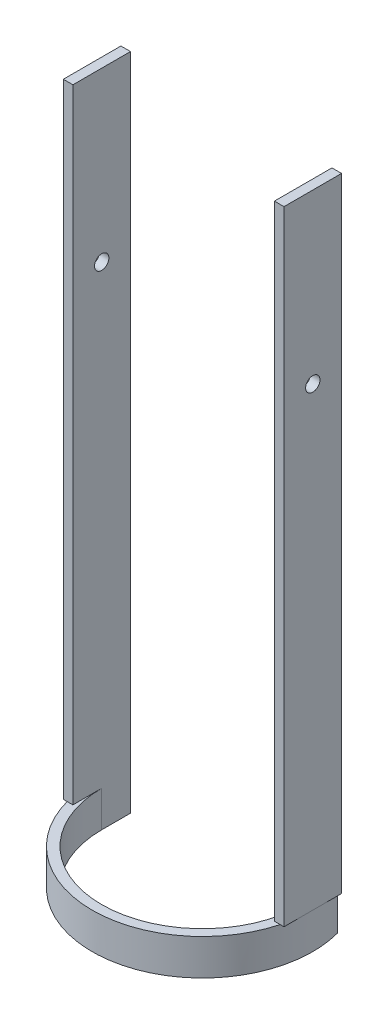
ISO-10303-21;
HEADER;
FILE_DESCRIPTION(('STEP AP214'),'2;1');
FILE_NAME('part.step','',(''),(''),'','','');
FILE_SCHEMA(('AUTOMOTIVE_DESIGN { 1 0 10303 214 1 1 1 1 }'));
ENDSEC;
DATA;
#1=APPLICATION_CONTEXT('core data for automotive mechanical design processes');
#2=APPLICATION_PROTOCOL_DEFINITION('international standard','automotive_design',2000,#1);
#3=PRODUCT_CONTEXT('',#1,'mechanical');
#4=PRODUCT('Part','Part','',(#3));
#5=PRODUCT_RELATED_PRODUCT_CATEGORY('part','',(#4));
#6=PRODUCT_DEFINITION_FORMATION('','',#4);
#7=PRODUCT_DEFINITION_CONTEXT('part definition',#1,'design');
#8=PRODUCT_DEFINITION('design','',#6,#7);
#9=PRODUCT_DEFINITION_SHAPE('','',#8);
#10=(LENGTH_UNIT() NAMED_UNIT(*) SI_UNIT(.MILLI.,.METRE.));
#11=(NAMED_UNIT(*) PLANE_ANGLE_UNIT() SI_UNIT($,.RADIAN.));
#12=(NAMED_UNIT(*) SI_UNIT($,.STERADIAN.) SOLID_ANGLE_UNIT());
#13=UNCERTAINTY_MEASURE_WITH_UNIT(LENGTH_MEASURE(1.E-05),#10,'distance_accuracy_value','');
#14=(GEOMETRIC_REPRESENTATION_CONTEXT(3) GLOBAL_UNCERTAINTY_ASSIGNED_CONTEXT((#13)) GLOBAL_UNIT_ASSIGNED_CONTEXT((#10,
#11,#12)) REPRESENTATION_CONTEXT('',''));
#15=CARTESIAN_POINT('',(0.,0.,0.));
#16=DIRECTION('',(0.,0.,1.));
#17=DIRECTION('',(1.,0.,0.));
#18=AXIS2_PLACEMENT_3D('',#15,#16,#17);
#19=CARTESIAN_POINT('',(-46.,30.,-12.));
#20=DIRECTION('',(0.,0.,1.));
#21=DIRECTION('',(1.,0.,0.));
#22=AXIS2_PLACEMENT_3D('',#19,#20,#21);
#23=PLANE('',#22);
#24=DIRECTION('',(1.,0.,0.));
#25=VECTOR('',#24,1.);
#26=CARTESIAN_POINT('',(-46.,30.,-12.));
#27=LINE('',#26,#25);
#28=CARTESIAN_POINT('',(-46.,30.,-12.));
#29=VERTEX_POINT('',#28);
#30=CARTESIAN_POINT('',(-44.407206622349,30.,-12.));
#31=VERTEX_POINT('',#30);
#32=EDGE_CURVE('E161',#29,#31,#27,.T.);
#33=ORIENTED_EDGE('',*,*,#32,.F.);
#34=DIRECTION('',(0.,-1.,0.));
#35=VECTOR('',#34,1.);
#36=CARTESIAN_POINT('',(-46.,30.,-12.));
#37=LINE('',#36,#35);
#38=CARTESIAN_POINT('',(-46.,290.,-12.));
#39=VERTEX_POINT('',#38);
#40=EDGE_CURVE('E247',#39,#29,#37,.T.);
#41=ORIENTED_EDGE('',*,*,#40,.F.);
#42=DIRECTION('',(-1.,0.,0.));
#43=VECTOR('',#42,1.);
#44=CARTESIAN_POINT('',(-46.,290.,-12.));
#45=LINE('',#44,#43);
#46=CARTESIAN_POINT('',(-42.,290.,-12.));
#47=VERTEX_POINT('',#46);
#48=EDGE_CURVE('E188',#47,#39,#45,.T.);
#49=ORIENTED_EDGE('',*,*,#48,.F.);
#50=DIRECTION('',(0.,-1.,0.));
#51=VECTOR('',#50,1.);
#52=CARTESIAN_POINT('',(-42.,30.,-12.));
#53=LINE('',#52,#51);
#54=CARTESIAN_POINT('',(-42.,15.,-12.));
#55=VERTEX_POINT('',#54);
#56=EDGE_CURVE('E222',#47,#55,#53,.T.);
#57=ORIENTED_EDGE('',*,*,#56,.T.);
#58=DIRECTION('',(1.,0.,0.));
#59=VECTOR('',#58,1.);
#60=CARTESIAN_POINT('',(66.6226252004804,15.,-12.));
#61=LINE('',#60,#59);
#62=CARTESIAN_POINT('',(-44.407206622349,15.,-12.));
#63=VERTEX_POINT('',#62);
#64=EDGE_CURVE('E172',#63,#55,#61,.T.);
#65=ORIENTED_EDGE('',*,*,#64,.F.);
#66=DIRECTION('',(0.,-1.,0.));
#67=VECTOR('',#66,1.);
#68=CARTESIAN_POINT('',(-44.407206622349,30.,-12.));
#69=LINE('',#68,#67);
#70=EDGE_CURVE('E143',#31,#63,#69,.T.);
#71=ORIENTED_EDGE('',*,*,#70,.F.);
#72=EDGE_LOOP('',(#33,#41,#49,#57,#65,#71));
#73=FACE_BOUND('',#72,.T.);
#74=ADVANCED_FACE('F34',(#73),#23,.F.);
#75=CARTESIAN_POINT('',(-46.,30.,0.));
#76=DIRECTION('',(1.,0.,0.));
#77=DIRECTION('',(0.,0.,-1.));
#78=AXIS2_PLACEMENT_3D('',#75,#76,#77);
#79=PLANE('',#78);
#80=CARTESIAN_POINT('',(-46.,220.,0.));
#81=DIRECTION('',(1.,0.,0.));
#82=DIRECTION('',(0.,0.,-1.));
#83=AXIS2_PLACEMENT_3D('',#80,#81,#82);
#84=CIRCLE('',#83,3.);
#85=CARTESIAN_POINT('',(-46.,220.,-3.));
#86=VERTEX_POINT('',#85);
#87=EDGE_CURVE('E159',#86,#86,#84,.T.);
#88=ORIENTED_EDGE('',*,*,#87,.T.);
#89=EDGE_LOOP('',(#88));
#90=FACE_BOUND('',#89,.T.);
#91=DIRECTION('',(0.,0.,-1.));
#92=VECTOR('',#91,1.);
#93=CARTESIAN_POINT('',(-46.,30.,0.));
#94=LINE('',#93,#92);
#95=CARTESIAN_POINT('',(-46.,30.,0.));
#96=VERTEX_POINT('',#95);
#97=EDGE_CURVE('E271',#96,#29,#94,.T.);
#98=ORIENTED_EDGE('',*,*,#97,.F.);
#99=DIRECTION('',(0.,0.,1.));
#100=VECTOR('',#99,1.);
#101=CARTESIAN_POINT('',(-46.,30.,-12.));
#102=LINE('',#101,#100);
#103=CARTESIAN_POINT('',(-46.,30.,12.));
#104=VERTEX_POINT('',#103);
#105=EDGE_CURVE('E178',#96,#104,#102,.T.);
#106=ORIENTED_EDGE('',*,*,#105,.T.);
#107=DIRECTION('',(0.,-1.,0.));
#108=VECTOR('',#107,1.);
#109=CARTESIAN_POINT('',(-46.,290.,12.));
#110=LINE('',#109,#108);
#111=CARTESIAN_POINT('',(-46.,290.,12.));
#112=VERTEX_POINT('',#111);
#113=EDGE_CURVE('E200',#112,#104,#110,.T.);
#114=ORIENTED_EDGE('',*,*,#113,.F.);
#115=DIRECTION('',(0.,0.,1.));
#116=VECTOR('',#115,1.);
#117=CARTESIAN_POINT('',(-46.,290.,-12.));
#118=LINE('',#117,#116);
#119=EDGE_CURVE('E179',#39,#112,#118,.T.);
#120=ORIENTED_EDGE('',*,*,#119,.F.);
#121=ORIENTED_EDGE('',*,*,#40,.T.);
#122=EDGE_LOOP('',(#98,#106,#114,#120,#121));
#123=FACE_BOUND('',#122,.T.);
#124=ADVANCED_FACE('F270',(#90,#123),#79,.F.);
#125=CARTESIAN_POINT('',(46.,30.,0.));
#126=DIRECTION('',(-1.,0.,0.));
#127=DIRECTION('',(0.,0.,1.));
#128=AXIS2_PLACEMENT_3D('',#125,#126,#127);
#129=PLANE('',#128);
#130=CARTESIAN_POINT('',(46.,220.,0.));
#131=DIRECTION('',(1.,0.,0.));
#132=DIRECTION('',(0.,0.,-1.));
#133=AXIS2_PLACEMENT_3D('',#130,#131,#132);
#134=CIRCLE('',#133,3.);
#135=CARTESIAN_POINT('',(46.,220.,-3.));
#136=VERTEX_POINT('',#135);
#137=EDGE_CURVE('E156',#136,#136,#134,.T.);
#138=ORIENTED_EDGE('',*,*,#137,.F.);
#139=EDGE_LOOP('',(#138));
#140=FACE_BOUND('',#139,.T.);
#141=DIRECTION('',(0.,0.,1.));
#142=VECTOR('',#141,1.);
#143=CARTESIAN_POINT('',(46.,30.,0.));
#144=LINE('',#143,#142);
#145=CARTESIAN_POINT('',(46.,30.,-12.));
#146=VERTEX_POINT('',#145);
#147=CARTESIAN_POINT('',(46.,30.,0.));
#148=VERTEX_POINT('',#147);
#149=EDGE_CURVE('E149',#146,#148,#144,.T.);
#150=ORIENTED_EDGE('',*,*,#149,.F.);
#151=DIRECTION('',(0.,-1.,0.));
#152=VECTOR('',#151,1.);
#153=CARTESIAN_POINT('',(46.,30.,-12.));
#154=LINE('',#153,#152);
#155=CARTESIAN_POINT('',(46.,290.,-12.));
#156=VERTEX_POINT('',#155);
#157=EDGE_CURVE('E155',#156,#146,#154,.T.);
#158=ORIENTED_EDGE('',*,*,#157,.F.);
#159=DIRECTION('',(0.,0.,-1.));
#160=VECTOR('',#159,1.);
#161=CARTESIAN_POINT('',(46.,290.,-12.));
#162=LINE('',#161,#160);
#163=CARTESIAN_POINT('',(46.,290.,12.));
#164=VERTEX_POINT('',#163);
#165=EDGE_CURVE('E204',#164,#156,#162,.T.);
#166=ORIENTED_EDGE('',*,*,#165,.F.);
#167=DIRECTION('',(0.,-1.,0.));
#168=VECTOR('',#167,1.);
#169=CARTESIAN_POINT('',(46.,290.,12.));
#170=LINE('',#169,#168);
#171=CARTESIAN_POINT('',(46.,30.,12.));
#172=VERTEX_POINT('',#171);
#173=EDGE_CURVE('E215',#164,#172,#170,.T.);
#174=ORIENTED_EDGE('',*,*,#173,.T.);
#175=DIRECTION('',(0.,0.,-1.));
#176=VECTOR('',#175,1.);
#177=CARTESIAN_POINT('',(46.,30.,-12.));
#178=LINE('',#177,#176);
#179=EDGE_CURVE('E203',#172,#148,#178,.T.);
#180=ORIENTED_EDGE('',*,*,#179,.T.);
#181=EDGE_LOOP('',(#150,#158,#166,#174,#180));
#182=FACE_BOUND('',#181,.T.);
#183=ADVANCED_FACE('F298',(#140,#182),#129,.F.);
#184=CARTESIAN_POINT('',(46.,30.,-12.));
#185=DIRECTION('',(0.,0.,1.));
#186=DIRECTION('',(1.,0.,0.));
#187=AXIS2_PLACEMENT_3D('',#184,#185,#186);
#188=PLANE('',#187);
#189=DIRECTION('',(1.,0.,0.));
#190=VECTOR('',#189,1.);
#191=CARTESIAN_POINT('',(46.,30.,-12.));
#192=LINE('',#191,#190);
#193=CARTESIAN_POINT('',(44.407206622349,30.,-12.));
#194=VERTEX_POINT('',#193);
#195=EDGE_CURVE('E147',#194,#146,#192,.T.);
#196=ORIENTED_EDGE('',*,*,#195,.F.);
#197=DIRECTION('',(0.,-1.,0.));
#198=VECTOR('',#197,1.);
#199=CARTESIAN_POINT('',(44.407206622349,30.,-12.));
#200=LINE('',#199,#198);
#201=CARTESIAN_POINT('',(44.407206622349,15.,-12.));
#202=VERTEX_POINT('',#201);
#203=EDGE_CURVE('E134',#202,#194,#200,.F.);
#204=ORIENTED_EDGE('',*,*,#203,.F.);
#205=CARTESIAN_POINT('',(42.,15.,-12.));
#206=VERTEX_POINT('',#205);
#207=EDGE_CURVE('E170',#206,#202,#61,.T.);
#208=ORIENTED_EDGE('',*,*,#207,.F.);
#209=DIRECTION('',(0.,-1.,0.));
#210=VECTOR('',#209,1.);
#211=CARTESIAN_POINT('',(42.,30.,-12.));
#212=LINE('',#211,#210);
#213=CARTESIAN_POINT('',(42.,290.,-12.));
#214=VERTEX_POINT('',#213);
#215=EDGE_CURVE('E243',#214,#206,#212,.T.);
#216=ORIENTED_EDGE('',*,*,#215,.F.);
#217=DIRECTION('',(-1.,0.,0.));
#218=VECTOR('',#217,1.);
#219=CARTESIAN_POINT('',(46.,290.,-12.));
#220=LINE('',#219,#218);
#221=EDGE_CURVE('E207',#156,#214,#220,.T.);
#222=ORIENTED_EDGE('',*,*,#221,.F.);
#223=ORIENTED_EDGE('',*,*,#157,.T.);
#224=EDGE_LOOP('',(#196,#204,#208,#216,#222,#223));
#225=FACE_BOUND('',#224,.T.);
#226=ADVANCED_FACE('F153',(#225),#188,.F.);
#227=CARTESIAN_POINT('',(66.6226252004804,15.,46.));
#228=DIRECTION('',(0.,1.,0.));
#229=DIRECTION('',(0.,0.,1.));
#230=AXIS2_PLACEMENT_3D('',#227,#228,#229);
#231=PLANE('',#230);
#232=ORIENTED_EDGE('',*,*,#207,.T.);
#233=CARTESIAN_POINT('',(0.,15.,0.));
#234=DIRECTION('',(0.,1.,0.));
#235=DIRECTION('',(0.,0.,1.));
#236=AXIS2_PLACEMENT_3D('',#233,#234,#235);
#237=CIRCLE('',#236,46.);
#238=EDGE_CURVE('E50',#63,#202,#237,.T.);
#239=ORIENTED_EDGE('',*,*,#238,.F.);
#240=ORIENTED_EDGE('',*,*,#64,.T.);
#241=DIRECTION('',(0.,0.,-1.));
#242=VECTOR('',#241,1.);
#243=CARTESIAN_POINT('',(-42.,15.,0.));
#244=LINE('',#243,#242);
#245=CARTESIAN_POINT('',(-42.,15.,0.));
#246=VERTEX_POINT('',#245);
#247=EDGE_CURVE('E56',#246,#55,#244,.T.);
#248=ORIENTED_EDGE('',*,*,#247,.F.);
#249=CARTESIAN_POINT('',(0.,15.,0.));
#250=DIRECTION('',(0.,1.,0.));
#251=DIRECTION('',(0.,0.,1.));
#252=AXIS2_PLACEMENT_3D('',#249,#250,#251);
#253=CIRCLE('',#252,42.);
#254=CARTESIAN_POINT('',(42.,15.,0.));
#255=VERTEX_POINT('',#254);
#256=EDGE_CURVE('E11',#255,#246,#253,.F.);
#257=ORIENTED_EDGE('',*,*,#256,.F.);
#258=DIRECTION('',(0.,0.,1.));
#259=VECTOR('',#258,1.);
#260=CARTESIAN_POINT('',(42.,15.,0.));
#261=LINE('',#260,#259);
#262=EDGE_CURVE('E173',#206,#255,#261,.T.);
#263=ORIENTED_EDGE('',*,*,#262,.F.);
#264=EDGE_LOOP('',(#232,#239,#240,#248,#257,#263));
#265=FACE_BOUND('',#264,.T.);
#266=ADVANCED_FACE('F280',(#265),#231,.F.);
#267=CARTESIAN_POINT('',(0.,30.,0.));
#268=DIRECTION('',(0.,1.,0.));
#269=DIRECTION('',(0.,0.,1.));
#270=AXIS2_PLACEMENT_3D('',#267,#268,#269);
#271=PLANE('',#270);
#272=DIRECTION('',(0.,0.,-1.));
#273=VECTOR('',#272,1.);
#274=CARTESIAN_POINT('',(-42.,30.,-12.));
#275=LINE('',#274,#273);
#276=CARTESIAN_POINT('',(-42.,30.,12.));
#277=VERTEX_POINT('',#276);
#278=CARTESIAN_POINT('',(-42.,30.,0.));
#279=VERTEX_POINT('',#278);
#280=EDGE_CURVE('E183',#277,#279,#275,.T.);
#281=ORIENTED_EDGE('',*,*,#280,.F.);
#282=DIRECTION('',(-1.,0.,0.));
#283=VECTOR('',#282,1.);
#284=CARTESIAN_POINT('',(0.,30.,12.));
#285=LINE('',#284,#283);
#286=CARTESIAN_POINT('',(-44.407206622349,30.,12.));
#287=VERTEX_POINT('',#286);
#288=EDGE_CURVE('E43',#277,#287,#285,.T.);
#289=ORIENTED_EDGE('',*,*,#288,.T.);
#290=CARTESIAN_POINT('',(0.,30.,0.));
#291=DIRECTION('',(0.,1.,0.));
#292=DIRECTION('',(0.,0.,1.));
#293=AXIS2_PLACEMENT_3D('',#290,#291,#292);
#294=CIRCLE('',#293,46.);
#295=CARTESIAN_POINT('',(44.407206622349,30.,12.));
#296=VERTEX_POINT('',#295);
#297=EDGE_CURVE('E235',#287,#296,#294,.T.);
#298=ORIENTED_EDGE('',*,*,#297,.T.);
#299=DIRECTION('',(1.,0.,0.));
#300=VECTOR('',#299,1.);
#301=CARTESIAN_POINT('',(46.,30.,12.));
#302=LINE('',#301,#300);
#303=CARTESIAN_POINT('',(42.,30.,12.));
#304=VERTEX_POINT('',#303);
#305=EDGE_CURVE('E208',#304,#296,#302,.T.);
#306=ORIENTED_EDGE('',*,*,#305,.F.);
#307=DIRECTION('',(0.,0.,1.));
#308=VECTOR('',#307,1.);
#309=CARTESIAN_POINT('',(42.,30.,-12.));
#310=LINE('',#309,#308);
#311=CARTESIAN_POINT('',(42.,30.,0.));
#312=VERTEX_POINT('',#311);
#313=EDGE_CURVE('E219',#312,#304,#310,.T.);
#314=ORIENTED_EDGE('',*,*,#313,.F.);
#315=CARTESIAN_POINT('',(0.,30.,0.));
#316=DIRECTION('',(0.,-1.,0.));
#317=DIRECTION('',(0.,0.,1.));
#318=AXIS2_PLACEMENT_3D('',#315,#316,#317);
#319=CIRCLE('',#318,42.);
#320=EDGE_CURVE('E234',#312,#279,#319,.T.);
#321=ORIENTED_EDGE('',*,*,#320,.T.);
#322=EDGE_LOOP('',(#281,#289,#298,#306,#314,#321));
#323=FACE_BOUND('',#322,.T.);
#324=ADVANCED_FACE('F255',(#323),#271,.T.);
#325=CARTESIAN_POINT('',(-42.,30.,0.));
#326=DIRECTION('',(-1.,0.,0.));
#327=DIRECTION('',(0.,0.,1.));
#328=AXIS2_PLACEMENT_3D('',#325,#326,#327);
#329=PLANE('',#328);
#330=CARTESIAN_POINT('',(-42.,220.,0.));
#331=DIRECTION('',(-1.,0.,0.));
#332=DIRECTION('',(0.,0.,1.));
#333=AXIS2_PLACEMENT_3D('',#330,#331,#332);
#334=CIRCLE('',#333,3.);
#335=CARTESIAN_POINT('',(-42.,220.,3.));
#336=VERTEX_POINT('',#335);
#337=EDGE_CURVE('E167',#336,#336,#334,.T.);
#338=ORIENTED_EDGE('',*,*,#337,.T.);
#339=EDGE_LOOP('',(#338));
#340=FACE_BOUND('',#339,.T.);
#341=DIRECTION('',(0.,-1.,0.));
#342=VECTOR('',#341,1.);
#343=CARTESIAN_POINT('',(-42.,30.,0.));
#344=LINE('',#343,#342);
#345=EDGE_CURVE('E237',#279,#246,#344,.T.);
#346=ORIENTED_EDGE('',*,*,#345,.T.);
#347=ORIENTED_EDGE('',*,*,#247,.T.);
#348=ORIENTED_EDGE('',*,*,#56,.F.);
#349=DIRECTION('',(0.,0.,-1.));
#350=VECTOR('',#349,1.);
#351=CARTESIAN_POINT('',(-42.,290.,-12.));
#352=LINE('',#351,#350);
#353=CARTESIAN_POINT('',(-42.,290.,12.));
#354=VERTEX_POINT('',#353);
#355=EDGE_CURVE('E185',#354,#47,#352,.T.);
#356=ORIENTED_EDGE('',*,*,#355,.F.);
#357=DIRECTION('',(0.,-1.,0.));
#358=VECTOR('',#357,1.);
#359=CARTESIAN_POINT('',(-42.,290.,12.));
#360=LINE('',#359,#358);
#361=EDGE_CURVE('E191',#354,#277,#360,.T.);
#362=ORIENTED_EDGE('',*,*,#361,.T.);
#363=ORIENTED_EDGE('',*,*,#280,.T.);
#364=EDGE_LOOP('',(#346,#347,#348,#356,#362,#363));
#365=FACE_BOUND('',#364,.T.);
#366=ADVANCED_FACE('F36',(#340,#365),#329,.F.);
#367=CARTESIAN_POINT('',(0.,30.,0.));
#368=DIRECTION('',(0.,-1.,0.));
#369=DIRECTION('',(0.,0.,-1.));
#370=AXIS2_PLACEMENT_3D('',#367,#368,#369);
#371=CYLINDRICAL_SURFACE('',#370,46.);
#372=ORIENTED_EDGE('',*,*,#238,.T.);
#373=ORIENTED_EDGE('',*,*,#203,.T.);
#374=CARTESIAN_POINT('',(0.,30.,0.));
#375=DIRECTION('',(0.,-1.,0.));
#376=DIRECTION('',(0.,0.,-1.));
#377=AXIS2_PLACEMENT_3D('',#374,#375,#376);
#378=CIRCLE('',#377,46.);
#379=EDGE_CURVE('E138',#194,#148,#378,.T.);
#380=ORIENTED_EDGE('',*,*,#379,.T.);
#381=EDGE_CURVE('E230',#296,#148,#294,.T.);
#382=ORIENTED_EDGE('',*,*,#381,.F.);
#383=ORIENTED_EDGE('',*,*,#297,.F.);
#384=EDGE_CURVE('E231',#96,#287,#294,.T.);
#385=ORIENTED_EDGE('',*,*,#384,.F.);
#386=EDGE_CURVE('E150',#96,#31,#378,.T.);
#387=ORIENTED_EDGE('',*,*,#386,.T.);
#388=ORIENTED_EDGE('',*,*,#70,.T.);
#389=EDGE_LOOP('',(#372,#373,#380,#382,#383,#385,#387,#388));
#390=FACE_BOUND('',#389,.T.);
#391=ADVANCED_FACE('F136',(#390),#371,.T.);
#392=CARTESIAN_POINT('',(42.,30.,0.));
#393=DIRECTION('',(1.,0.,0.));
#394=DIRECTION('',(0.,0.,-1.));
#395=AXIS2_PLACEMENT_3D('',#392,#393,#394);
#396=PLANE('',#395);
#397=CARTESIAN_POINT('',(42.,220.,0.));
#398=DIRECTION('',(1.,0.,0.));
#399=DIRECTION('',(0.,0.,-1.));
#400=AXIS2_PLACEMENT_3D('',#397,#398,#399);
#401=CIRCLE('',#400,3.);
#402=CARTESIAN_POINT('',(42.,220.,-3.));
#403=VERTEX_POINT('',#402);
#404=EDGE_CURVE('E38',#403,#403,#401,.T.);
#405=ORIENTED_EDGE('',*,*,#404,.T.);
#406=EDGE_LOOP('',(#405));
#407=FACE_BOUND('',#406,.T.);
#408=ORIENTED_EDGE('',*,*,#215,.T.);
#409=ORIENTED_EDGE('',*,*,#262,.T.);
#410=DIRECTION('',(0.,-1.,0.));
#411=VECTOR('',#410,1.);
#412=CARTESIAN_POINT('',(42.,30.,0.));
#413=LINE('',#412,#411);
#414=EDGE_CURVE('E240',#312,#255,#413,.T.);
#415=ORIENTED_EDGE('',*,*,#414,.F.);
#416=ORIENTED_EDGE('',*,*,#313,.T.);
#417=DIRECTION('',(0.,-1.,0.));
#418=VECTOR('',#417,1.);
#419=CARTESIAN_POINT('',(42.,290.,12.));
#420=LINE('',#419,#418);
#421=CARTESIAN_POINT('',(42.,290.,12.));
#422=VERTEX_POINT('',#421);
#423=EDGE_CURVE('E227',#422,#304,#420,.T.);
#424=ORIENTED_EDGE('',*,*,#423,.F.);
#425=DIRECTION('',(0.,0.,1.));
#426=VECTOR('',#425,1.);
#427=CARTESIAN_POINT('',(42.,290.,-12.));
#428=LINE('',#427,#426);
#429=EDGE_CURVE('E211',#214,#422,#428,.T.);
#430=ORIENTED_EDGE('',*,*,#429,.F.);
#431=EDGE_LOOP('',(#408,#409,#415,#416,#424,#430));
#432=FACE_BOUND('',#431,.T.);
#433=ADVANCED_FACE('F289',(#407,#432),#396,.F.);
#434=CARTESIAN_POINT('',(0.,30.,0.));
#435=DIRECTION('',(0.,-1.,0.));
#436=DIRECTION('',(0.,0.,-1.));
#437=AXIS2_PLACEMENT_3D('',#434,#435,#436);
#438=CYLINDRICAL_SURFACE('',#437,42.);
#439=ORIENTED_EDGE('',*,*,#414,.T.);
#440=ORIENTED_EDGE('',*,*,#256,.T.);
#441=ORIENTED_EDGE('',*,*,#345,.F.);
#442=ORIENTED_EDGE('',*,*,#320,.F.);
#443=EDGE_LOOP('',(#439,#440,#441,#442));
#444=FACE_BOUND('',#443,.T.);
#445=ADVANCED_FACE('F286',(#444),#438,.F.);
#446=CARTESIAN_POINT('',(46.,290.,12.));
#447=DIRECTION('',(0.,0.,-1.));
#448=DIRECTION('',(-1.,0.,0.));
#449=AXIS2_PLACEMENT_3D('',#446,#447,#448);
#450=PLANE('',#449);
#451=ORIENTED_EDGE('',*,*,#305,.T.);
#452=EDGE_CURVE('E218',#296,#172,#302,.T.);
#453=ORIENTED_EDGE('',*,*,#452,.T.);
#454=ORIENTED_EDGE('',*,*,#173,.F.);
#455=DIRECTION('',(1.,0.,0.));
#456=VECTOR('',#455,1.);
#457=CARTESIAN_POINT('',(46.,290.,12.));
#458=LINE('',#457,#456);
#459=EDGE_CURVE('E213',#422,#164,#458,.T.);
#460=ORIENTED_EDGE('',*,*,#459,.F.);
#461=ORIENTED_EDGE('',*,*,#423,.T.);
#462=EDGE_LOOP('',(#451,#453,#454,#460,#461));
#463=FACE_BOUND('',#462,.T.);
#464=ADVANCED_FACE('F303',(#463),#450,.F.);
#465=CARTESIAN_POINT('',(0.,290.,0.));
#466=DIRECTION('',(0.,-1.,0.));
#467=DIRECTION('',(0.,0.,-1.));
#468=AXIS2_PLACEMENT_3D('',#465,#466,#467);
#469=PLANE('',#468);
#470=ORIENTED_EDGE('',*,*,#165,.T.);
#471=ORIENTED_EDGE('',*,*,#221,.T.);
#472=ORIENTED_EDGE('',*,*,#429,.T.);
#473=ORIENTED_EDGE('',*,*,#459,.T.);
#474=EDGE_LOOP('',(#470,#471,#472,#473));
#475=FACE_BOUND('',#474,.T.);
#476=ADVANCED_FACE('F293',(#475),#469,.F.);
#477=CARTESIAN_POINT('',(0.,30.,0.));
#478=DIRECTION('',(0.,-1.,0.));
#479=DIRECTION('',(0.,0.,-1.));
#480=AXIS2_PLACEMENT_3D('',#477,#478,#479);
#481=PLANE('',#480);
#482=ORIENTED_EDGE('',*,*,#452,.F.);
#483=ORIENTED_EDGE('',*,*,#381,.T.);
#484=ORIENTED_EDGE('',*,*,#179,.F.);
#485=EDGE_LOOP('',(#482,#483,#484));
#486=FACE_BOUND('',#485,.T.);
#487=ADVANCED_FACE('F301',(#486),#481,.T.);
#488=CARTESIAN_POINT('',(0.,30.,0.));
#489=DIRECTION('',(0.,1.,0.));
#490=DIRECTION('',(0.,0.,1.));
#491=AXIS2_PLACEMENT_3D('',#488,#489,#490);
#492=PLANE('',#491);
#493=ORIENTED_EDGE('',*,*,#105,.F.);
#494=ORIENTED_EDGE('',*,*,#384,.T.);
#495=DIRECTION('',(1.,0.,0.));
#496=VECTOR('',#495,1.);
#497=CARTESIAN_POINT('',(-46.,30.,12.));
#498=LINE('',#497,#496);
#499=EDGE_CURVE('E193',#104,#287,#498,.T.);
#500=ORIENTED_EDGE('',*,*,#499,.F.);
#501=EDGE_LOOP('',(#493,#494,#500));
#502=FACE_BOUND('',#501,.T.);
#503=ADVANCED_FACE('F264',(#502),#492,.F.);
#504=CARTESIAN_POINT('',(-46.,290.,12.));
#505=DIRECTION('',(0.,0.,-1.));
#506=DIRECTION('',(-1.,0.,0.));
#507=AXIS2_PLACEMENT_3D('',#504,#505,#506);
#508=PLANE('',#507);
#509=ORIENTED_EDGE('',*,*,#499,.T.);
#510=ORIENTED_EDGE('',*,*,#288,.F.);
#511=ORIENTED_EDGE('',*,*,#361,.F.);
#512=DIRECTION('',(1.,0.,0.));
#513=VECTOR('',#512,1.);
#514=CARTESIAN_POINT('',(-46.,290.,12.));
#515=LINE('',#514,#513);
#516=EDGE_CURVE('E182',#112,#354,#515,.T.);
#517=ORIENTED_EDGE('',*,*,#516,.F.);
#518=ORIENTED_EDGE('',*,*,#113,.T.);
#519=EDGE_LOOP('',(#509,#510,#511,#517,#518));
#520=FACE_BOUND('',#519,.T.);
#521=ADVANCED_FACE('F265',(#520),#508,.F.);
#522=CARTESIAN_POINT('',(0.,290.,0.));
#523=DIRECTION('',(0.,1.,0.));
#524=DIRECTION('',(0.,0.,1.));
#525=AXIS2_PLACEMENT_3D('',#522,#523,#524);
#526=PLANE('',#525);
#527=ORIENTED_EDGE('',*,*,#119,.T.);
#528=ORIENTED_EDGE('',*,*,#516,.T.);
#529=ORIENTED_EDGE('',*,*,#355,.T.);
#530=ORIENTED_EDGE('',*,*,#48,.T.);
#531=EDGE_LOOP('',(#527,#528,#529,#530));
#532=FACE_BOUND('',#531,.T.);
#533=ADVANCED_FACE('F343',(#532),#526,.T.);
#534=CARTESIAN_POINT('',(-46.,220.,0.));
#535=DIRECTION('',(1.,0.,0.));
#536=DIRECTION('',(0.,0.,-1.));
#537=AXIS2_PLACEMENT_3D('',#534,#535,#536);
#538=CYLINDRICAL_SURFACE('',#537,3.);
#539=ORIENTED_EDGE('',*,*,#137,.T.);
#540=EDGE_LOOP('',(#539));
#541=FACE_BOUND('',#540,.T.);
#542=ORIENTED_EDGE('',*,*,#404,.F.);
#543=EDGE_LOOP('',(#542));
#544=FACE_BOUND('',#543,.T.);
#545=ADVANCED_FACE('F346',(#541,#544),#538,.F.);
#546=ORIENTED_EDGE('',*,*,#87,.F.);
#547=EDGE_LOOP('',(#546));
#548=FACE_BOUND('',#547,.T.);
#549=ORIENTED_EDGE('',*,*,#337,.F.);
#550=EDGE_LOOP('',(#549));
#551=FACE_BOUND('',#550,.T.);
#552=ADVANCED_FACE('F341',(#548,#551),#538,.F.);
#553=CARTESIAN_POINT('',(0.,30.,0.));
#554=DIRECTION('',(0.,-1.,0.));
#555=DIRECTION('',(0.,0.,-1.));
#556=AXIS2_PLACEMENT_3D('',#553,#554,#555);
#557=PLANE('',#556);
#558=ORIENTED_EDGE('',*,*,#32,.T.);
#559=ORIENTED_EDGE('',*,*,#386,.F.);
#560=ORIENTED_EDGE('',*,*,#97,.T.);
#561=EDGE_LOOP('',(#558,#559,#560));
#562=FACE_BOUND('',#561,.T.);
#563=ADVANCED_FACE('F384',(#562),#557,.T.);
#564=ORIENTED_EDGE('',*,*,#195,.T.);
#565=ORIENTED_EDGE('',*,*,#149,.T.);
#566=ORIENTED_EDGE('',*,*,#379,.F.);
#567=EDGE_LOOP('',(#564,#565,#566));
#568=FACE_BOUND('',#567,.T.);
#569=ADVANCED_FACE('F146',(#568),#557,.T.);
#570=CLOSED_SHELL('',(#74,#124,#183,#226,#266,#324,#366,#391,#433,#445,#464,#476,#487,#503,#521,
#533,#545,#552,#563,#569));
#571=MANIFOLD_SOLID_BREP('B2',#570);
#572=ADVANCED_BREP_SHAPE_REPRESENTATION('',(#18,#571),#14);
#573=SHAPE_DEFINITION_REPRESENTATION(#9,#572);
ENDSEC;
END-ISO-10303-21;
